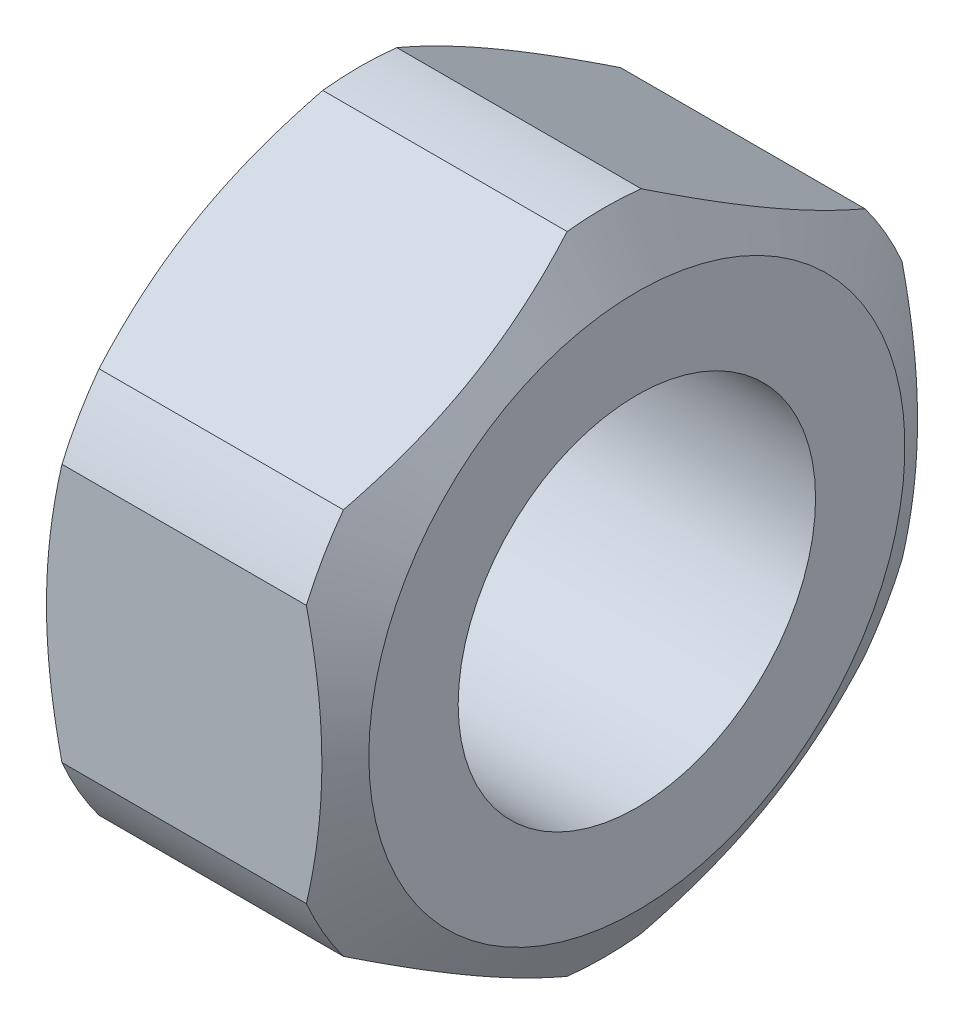
ISO-10303-21;
HEADER;
FILE_DESCRIPTION(('STEP AP214'),'2;1');
FILE_NAME('part.step','',(''),(''),'','','');
FILE_SCHEMA(('AUTOMOTIVE_DESIGN { 1 0 10303 214 1 1 1 1 }'));
ENDSEC;
DATA;
#1=APPLICATION_CONTEXT('core data for automotive mechanical design processes');
#2=APPLICATION_PROTOCOL_DEFINITION('international standard','automotive_design',2000,#1);
#3=PRODUCT_CONTEXT('',#1,'mechanical');
#4=PRODUCT('Part','Part','',(#3));
#5=PRODUCT_RELATED_PRODUCT_CATEGORY('part','',(#4));
#6=PRODUCT_DEFINITION_FORMATION('','',#4);
#7=PRODUCT_DEFINITION_CONTEXT('part definition',#1,'design');
#8=PRODUCT_DEFINITION('design','',#6,#7);
#9=PRODUCT_DEFINITION_SHAPE('','',#8);
#10=(LENGTH_UNIT() NAMED_UNIT(*) SI_UNIT(.MILLI.,.METRE.));
#11=(NAMED_UNIT(*) PLANE_ANGLE_UNIT() SI_UNIT($,.RADIAN.));
#12=(NAMED_UNIT(*) SI_UNIT($,.STERADIAN.) SOLID_ANGLE_UNIT());
#13=UNCERTAINTY_MEASURE_WITH_UNIT(LENGTH_MEASURE(1.E-05),#10,'distance_accuracy_value','');
#14=(GEOMETRIC_REPRESENTATION_CONTEXT(3) GLOBAL_UNCERTAINTY_ASSIGNED_CONTEXT((#13)) GLOBAL_UNIT_ASSIGNED_CONTEXT((#10,
#11,#12)) REPRESENTATION_CONTEXT('',''));
#15=CARTESIAN_POINT('',(0.,0.,0.));
#16=DIRECTION('',(0.,0.,1.));
#17=DIRECTION('',(1.,0.,0.));
#18=AXIS2_PLACEMENT_3D('',#15,#16,#17);
#19=CARTESIAN_POINT('',(2.59999999999999,0.,0.));
#20=DIRECTION('',(-1.,0.,0.));
#21=DIRECTION('',(0.,0.,1.));
#22=AXIS2_PLACEMENT_3D('',#19,#20,#21);
#23=CONICAL_SURFACE('',#22,4.5,1.04719755119658);
#24=CARTESIAN_POINT('',(2.59999999999999,0.,0.));
#25=DIRECTION('',(-1.,0.,0.));
#26=DIRECTION('',(0.,0.,1.));
#27=AXIS2_PLACEMENT_3D('',#24,#25,#26);
#28=CIRCLE('',#27,4.5);
#29=CARTESIAN_POINT('',(2.59999999999999,0.,4.5));
#30=VERTEX_POINT('',#29);
#31=EDGE_CURVE('E133',#30,#30,#28,.T.);
#32=ORIENTED_EDGE('',*,*,#31,.T.);
#33=EDGE_LOOP('',(#32));
#34=FACE_BOUND('',#33,.T.);
#35=CARTESIAN_POINT('',(2.05131724426983,-3.24542936626034,-4.37875144526102));
#36=CARTESIAN_POINT('',(2.07923882489737,-3.30617263599719,-4.27354101585894));
#37=CARTESIAN_POINT('',(2.10528206102695,-3.36713837569772,-4.1679452571766));
#38=CARTESIAN_POINT('',(2.15322100869743,-3.48949300677645,-3.9560208196069));
#39=CARTESIAN_POINT('',(2.17511554419071,-3.55088201304372,-3.84969194172582));
#40=CARTESIAN_POINT('',(2.21436819896125,-3.67408408537616,-3.63629969284827));
#41=CARTESIAN_POINT('',(2.23172209046221,-3.73589749204242,-3.52923573191338));
#42=CARTESIAN_POINT('',(2.26152058518306,-3.85981081626848,-3.31461155861909));
#43=CARTESIAN_POINT('',(2.27396566900335,-3.92191070517744,-3.20705139588438));
#44=CARTESIAN_POINT('',(2.30312584464357,-4.10622630246895,-2.88780741674809));
#45=CARTESIAN_POINT('',(2.3124173444287,-4.22876086738908,-2.67557132462308));
#46=CARTESIAN_POINT('',(2.3100267904695,-4.47368971946696,-2.25134210858466));
#47=CARTESIAN_POINT('',(2.29835980331101,-4.59608404415355,-2.03934891966941));
#48=CARTESIAN_POINT('',(2.26645641965094,-4.77638680874153,-1.72705537065789));
#49=CARTESIAN_POINT('',(2.25385446321645,-4.83466079681659,-1.62612186255223));
#50=CARTESIAN_POINT('',(2.22436980583317,-4.95093995384992,-1.42472045470923));
#51=CARTESIAN_POINT('',(2.20748710749956,-5.00894512297239,-1.32425255468748));
#52=CARTESIAN_POINT('',(2.16956010040713,-5.12515455701401,-1.12297191060857));
#53=CARTESIAN_POINT('',(2.14847921277964,-5.18335580663219,-1.02216438920587));
#54=CARTESIAN_POINT('',(2.10260065602001,-5.29937937474609,-0.821205674357187));
#55=CARTESIAN_POINT('',(2.07780375106761,-5.35720176860576,-0.721054350376964));
#56=CARTESIAN_POINT('',(2.05131724426982,-5.41482467158407,-0.621248554738937));
#57=B_SPLINE_CURVE_WITH_KNOTS('',3,(#35,#36,#37,#38,#39,#40,#41,#42,#43,#44,#45,#46,#47,#48,#49,
#50,#51,#52,#53,#54,#55,#56),.UNSPECIFIED.,.F.,.F.,(4,2,2,2,2,2,2,2,2,2,4),(0.,
0.373965494225851,0.74803683976965,1.12245525216132,1.49683699774156,2.23164238927377,
2.96591975707377,3.31753662460585,3.66915327733021,4.02397933736215,4.37873252912962),.UNSPECIFIED.);
#58=CARTESIAN_POINT('',(2.05151724426983,-3.24586459681212,-4.37799760383234));
#59=VERTEX_POINT('',#58);
#60=CARTESIAN_POINT('',(2.05151724426983,-5.41438944103227,-0.62200239616766));
#61=VERTEX_POINT('',#60);
#62=EDGE_CURVE('E150',#59,#61,#57,.T.);
#63=ORIENTED_EDGE('',*,*,#62,.F.);
#64=CARTESIAN_POINT('',(2.05151724426983,0.,0.));
#65=DIRECTION('',(-1.,0.,0.));
#66=DIRECTION('',(0.,0.,1.));
#67=AXIS2_PLACEMENT_3D('',#64,#65,#66);
#68=CIRCLE('',#67,5.45);
#69=CARTESIAN_POINT('',(2.05151724426983,-2.16852484422014,-5.));
#70=VERTEX_POINT('',#69);
#71=EDGE_CURVE('E146',#70,#59,#68,.T.);
#72=ORIENTED_EDGE('',*,*,#71,.F.);
#73=CARTESIAN_POINT('',(-0.0495672017264119,-7.59034150565798,-5.));
#74=CARTESIAN_POINT('',(0.0560026913540689,-7.37131692534706,-5.));
#75=CARTESIAN_POINT('',(0.160502779935008,-7.15176699008767,-5.));
#76=CARTESIAN_POINT('',(0.366750448458029,-6.71133201523394,-5.));
#77=CARTESIAN_POINT('',(0.468497535890005,-6.49044674528403,-5.));
#78=CARTESIAN_POINT('',(0.669176772372656,-6.04583065445695,-5.));
#79=CARTESIAN_POINT('',(0.768088844596084,-5.82209073827513,-5.));
#80=CARTESIAN_POINT('',(0.961568656579241,-5.37274747739959,-5.));
#81=CARTESIAN_POINT('',(1.05613662838522,-5.14714423299945,-5.));
#82=CARTESIAN_POINT('',(1.24076721401034,-4.69122382459792,-5.));
#83=CARTESIAN_POINT('',(1.3307694759165,-4.46088208304005,-5.));
#84=CARTESIAN_POINT('',(1.5035594328375,-3.99745844994392,-5.));
#85=CARTESIAN_POINT('',(1.5863463180342,-3.76437625415388,-5.));
#86=CARTESIAN_POINT('',(1.7424328736015,-3.29560202899964,-5.));
#87=CARTESIAN_POINT('',(1.81575330313676,-3.05991698440947,-5.));
#88=CARTESIAN_POINT('',(1.95048337535986,-2.5852002286689,-5.));
#89=CARTESIAN_POINT('',(2.01189684875942,-2.34616962047854,-5.));
#90=CARTESIAN_POINT('',(2.1197962499697,-1.86457280933199,-5.));
#91=CARTESIAN_POINT('',(2.16627471497022,-1.62200490192479,-5.));
#92=CARTESIAN_POINT('',(2.24111961743884,-1.13401948311099,-5.));
#93=CARTESIAN_POINT('',(2.26948595579342,-0.888601956118144,-5.));
#94=CARTESIAN_POINT('',(2.30559589977272,-0.397706949149094,-5.));
#95=CARTESIAN_POINT('',(2.31346312981085,-0.152238799128253,-5.));
#96=CARTESIAN_POINT('',(2.30818607206311,0.338417087872911,-5.));
#97=CARTESIAN_POINT('',(2.29504690756262,0.583604878636448,-5.));
#98=CARTESIAN_POINT('',(2.25539266273733,1.00429772178018,-5.));
#99=CARTESIAN_POINT('',(2.23359731276719,1.18027121217217,-5.));
#100=CARTESIAN_POINT('',(2.18063844508255,1.53081361677885,-5.));
#101=CARTESIAN_POINT('',(2.14947347935944,1.70538230960726,-5.));
#102=CARTESIAN_POINT('',(2.04348034692544,2.22727444845192,-5.));
#103=CARTESIAN_POINT('',(1.9562269186882,2.57209623225185,-5.));
#104=CARTESIAN_POINT('',(1.80634256845427,3.0877649138985,-5.));
#105=CARTESIAN_POINT('',(1.75250319995882,3.26131787412038,-5.));
#106=CARTESIAN_POINT('',(1.63959530645157,3.60674690333853,-5.));
#107=CARTESIAN_POINT('',(1.58052631893646,3.77862282252328,-5.));
#108=CARTESIAN_POINT('',(1.45841442369726,4.11983850081856,-5.));
#109=CARTESIAN_POINT('',(1.39539604358607,4.28918712645536,-5.));
#110=CARTESIAN_POINT('',(1.26580008848779,4.62645343194172,-5.));
#111=CARTESIAN_POINT('',(1.19922373418467,4.79437157993151,-5.));
#112=CARTESIAN_POINT('',(1.13120361392375,4.96168904418337,-5.));
#113=B_SPLINE_CURVE_WITH_KNOTS('',3,(#73,#74,#75,#76,#77,#78,#79,#80,#81,#82,#83,#84,#85,#86,
#87,#88,#89,#90,#91,#92,#93,#94,#95,#96,#97,#98,#99,#100,#101,#102,#103,#104,#105,#106,#107,
#108,#109,#110,#111,#112),.UNSPECIFIED.,.F.,.F.,(4,2,2,2,2,2,2,2,2,2,2,2,2,2,2,2,2,2,2,4),(0.,
0.729428370395951,1.45898638361316,2.19283549734381,2.92664536579849,3.66845464347947,
4.41034707123128,5.15058390991073,5.89058220261327,6.63094968894745,7.37132122670016,
8.10721734418481,8.84293401008858,9.3746275776507,9.90640335701116,10.9720203896541,
11.5171157420705,12.0622593505308,12.604300671406,13.146157205745),.UNSPECIFIED.);
#114=CARTESIAN_POINT('',(2.05151724426983,2.16852484422014,-5.));
#115=VERTEX_POINT('',#114);
#116=EDGE_CURVE('E212',#115,#70,#113,.F.);
#117=ORIENTED_EDGE('',*,*,#116,.F.);
#118=CARTESIAN_POINT('',(2.05151724426983,3.24586459681213,-4.37799760383233));
#119=VERTEX_POINT('',#118);
#120=EDGE_CURVE('E149',#119,#115,#68,.T.);
#121=ORIENTED_EDGE('',*,*,#120,.F.);
#122=CARTESIAN_POINT('',(2.05131724426982,5.41482467158406,-0.621248554738949));
#123=CARTESIAN_POINT('',(2.07923882489736,5.35408140184721,-0.726458984141036));
#124=CARTESIAN_POINT('',(2.10528206102694,5.29311566214669,-0.832054742823369));
#125=CARTESIAN_POINT('',(2.15322100869742,5.17076103106796,-1.04397918039307));
#126=CARTESIAN_POINT('',(2.1751155441907,5.10937202480068,-1.15030805827415));
#127=CARTESIAN_POINT('',(2.21436819896125,4.98616995246825,-1.36370030715171));
#128=CARTESIAN_POINT('',(2.2317220904622,4.92435654580199,-1.47076426808659));
#129=CARTESIAN_POINT('',(2.26152058518306,4.80044322157593,-1.68538844138088));
#130=CARTESIAN_POINT('',(2.27396566900335,4.73834333266696,-1.7929486041156));
#131=CARTESIAN_POINT('',(2.30312584464356,4.55402773537546,-2.11219258325188));
#132=CARTESIAN_POINT('',(2.3124173444287,4.43149317045533,-2.3244286753769));
#133=CARTESIAN_POINT('',(2.3100267904695,4.18656431837744,-2.74865789141532));
#134=CARTESIAN_POINT('',(2.29835980331101,4.06416999369085,-2.96065108033057));
#135=CARTESIAN_POINT('',(2.26645641965094,3.88386722910287,-3.27294462934209));
#136=CARTESIAN_POINT('',(2.25385446321645,3.82559324102782,-3.37387813744774));
#137=CARTESIAN_POINT('',(2.22436980583317,3.70931408399449,-3.57527954529074));
#138=CARTESIAN_POINT('',(2.20748710749956,3.65130891487202,-3.67574744531249));
#139=CARTESIAN_POINT('',(2.16956010040714,3.5350994808304,-3.87702808939139));
#140=CARTESIAN_POINT('',(2.14847921277965,3.47689823121222,-3.97783561079409));
#141=CARTESIAN_POINT('',(2.10260065602002,3.36087466309833,-4.17879432564277));
#142=CARTESIAN_POINT('',(2.07780375106762,3.30305226923865,-4.27894564962299));
#143=CARTESIAN_POINT('',(2.05131724426983,3.24542936626035,-4.37875144526102));
#144=B_SPLINE_CURVE_WITH_KNOTS('',3,(#122,#123,#124,#125,#126,#127,#128,#129,#130,#131,#132,
#133,#134,#135,#136,#137,#138,#139,#140,#141,#142,#143),.UNSPECIFIED.,.F.,.F.,(4,2,2,2,2,2,2,2,
2,2,4),(0.,0.373965494225852,0.748036839769652,1.12245525216132,1.49683699774157,
2.23164238927378,2.96591975707378,3.31753662460585,3.6691532773302,4.02397933736213,
4.37873252912959),.UNSPECIFIED.);
#145=CARTESIAN_POINT('',(2.05151724426983,5.41438944103226,-0.622002396167673));
#146=VERTEX_POINT('',#145);
#147=EDGE_CURVE('E219',#146,#119,#144,.T.);
#148=ORIENTED_EDGE('',*,*,#147,.F.);
#149=CARTESIAN_POINT('',(2.05151724426983,5.41438944103226,0.622002396167667));
#150=VERTEX_POINT('',#149);
#151=EDGE_CURVE('E156',#150,#146,#68,.T.);
#152=ORIENTED_EDGE('',*,*,#151,.F.);
#153=CARTESIAN_POINT('',(2.05131724426983,3.24542936626035,4.37875144526102));
#154=CARTESIAN_POINT('',(2.07923882489737,3.3061726359972,4.27354101585893));
#155=CARTESIAN_POINT('',(2.10528206102695,3.36713837569773,4.1679452571766));
#156=CARTESIAN_POINT('',(2.15322100869743,3.48949300677645,3.9560208196069));
#157=CARTESIAN_POINT('',(2.17511554419071,3.55088201304373,3.84969194172582));
#158=CARTESIAN_POINT('',(2.21436819896125,3.67408408537616,3.63629969284826));
#159=CARTESIAN_POINT('',(2.23172209046221,3.73589749204242,3.52923573191338));
#160=CARTESIAN_POINT('',(2.26152058518306,3.85981081626849,3.31461155861909));
#161=CARTESIAN_POINT('',(2.27396566900335,3.92191070517745,3.20705139588437));
#162=CARTESIAN_POINT('',(2.30312584464356,4.10622630246895,2.88780741674809));
#163=CARTESIAN_POINT('',(2.3124173444287,4.22876086738908,2.67557132462308));
#164=CARTESIAN_POINT('',(2.3100267904695,4.47368971946697,2.25134210858466));
#165=CARTESIAN_POINT('',(2.29835980331101,4.59608404415356,2.0393489196694));
#166=CARTESIAN_POINT('',(2.26645641965093,4.77638680874154,1.72705537065789));
#167=CARTESIAN_POINT('',(2.25385446321644,4.8346607968166,1.62612186255223));
#168=CARTESIAN_POINT('',(2.22436980583317,4.95093995384992,1.42472045470923));
#169=CARTESIAN_POINT('',(2.20748710749956,5.00894512297239,1.32425255468748));
#170=CARTESIAN_POINT('',(2.16956010040713,5.12515455701401,1.12297191060857));
#171=CARTESIAN_POINT('',(2.14847921277964,5.1833558066322,1.02216438920588));
#172=CARTESIAN_POINT('',(2.10260065602001,5.29937937474609,0.821205674357192));
#173=CARTESIAN_POINT('',(2.07780375106761,5.35720176860576,0.72105435037697));
#174=CARTESIAN_POINT('',(2.05131724426982,5.41482467158406,0.621248554738944));
#175=B_SPLINE_CURVE_WITH_KNOTS('',3,(#153,#154,#155,#156,#157,#158,#159,#160,#161,#162,#163,
#164,#165,#166,#167,#168,#169,#170,#171,#172,#173,#174),.UNSPECIFIED.,.F.,.F.,(4,2,2,2,2,2,2,2,
2,2,4),(0.,0.37396549422585,0.748036839769649,1.12245525216132,1.49683699774156,
2.23164238927377,2.96591975707377,3.31753662460584,3.6691532773302,4.02397933736214,
4.3787325291296),.UNSPECIFIED.);
#176=CARTESIAN_POINT('',(2.05151724426983,3.24586459681213,4.37799760383233));
#177=VERTEX_POINT('',#176);
#178=EDGE_CURVE('E260',#177,#150,#175,.T.);
#179=ORIENTED_EDGE('',*,*,#178,.F.);
#180=CARTESIAN_POINT('',(2.05151724426983,2.16852484422015,5.));
#181=VERTEX_POINT('',#180);
#182=EDGE_CURVE('E151',#181,#177,#68,.T.);
#183=ORIENTED_EDGE('',*,*,#182,.F.);
#184=CARTESIAN_POINT('',(-0.0495672017264116,-7.59034150565798,5.));
#185=CARTESIAN_POINT('',(0.0560026913540693,-7.37131692534706,5.));
#186=CARTESIAN_POINT('',(0.160502779935008,-7.15176699008768,5.));
#187=CARTESIAN_POINT('',(0.366750448458029,-6.71133201523395,5.));
#188=CARTESIAN_POINT('',(0.468497535890004,-6.49044674528403,5.));
#189=CARTESIAN_POINT('',(0.669176772372656,-6.04583065445695,5.));
#190=CARTESIAN_POINT('',(0.768088844596084,-5.82209073827513,5.));
#191=CARTESIAN_POINT('',(0.961568656579242,-5.37274747739959,5.));
#192=CARTESIAN_POINT('',(1.05613662838522,-5.14714423299945,5.));
#193=CARTESIAN_POINT('',(1.24076721401034,-4.69122382459792,5.));
#194=CARTESIAN_POINT('',(1.3307694759165,-4.46088208304005,5.));
#195=CARTESIAN_POINT('',(1.5035594328375,-3.99745844994392,5.));
#196=CARTESIAN_POINT('',(1.5863463180342,-3.76437625415388,5.));
#197=CARTESIAN_POINT('',(1.74243287360151,-3.29560202899965,5.));
#198=CARTESIAN_POINT('',(1.81575330313676,-3.05991698440947,5.));
#199=CARTESIAN_POINT('',(1.95048337535986,-2.5852002286689,5.));
#200=CARTESIAN_POINT('',(2.01189684875942,-2.34616962047854,5.));
#201=CARTESIAN_POINT('',(2.1197962499697,-1.86457280933199,5.));
#202=CARTESIAN_POINT('',(2.16627471497022,-1.62200490192479,5.));
#203=CARTESIAN_POINT('',(2.24111961743884,-1.134019483111,5.));
#204=CARTESIAN_POINT('',(2.26948595579343,-0.888601956118146,5.));
#205=CARTESIAN_POINT('',(2.30559589977272,-0.397706949149096,5.));
#206=CARTESIAN_POINT('',(2.31346312981085,-0.152238799128255,5.));
#207=CARTESIAN_POINT('',(2.30818607206312,0.338417087872909,5.));
#208=CARTESIAN_POINT('',(2.29504690756262,0.583604878636445,5.));
#209=CARTESIAN_POINT('',(2.25539266273733,1.00429772178018,5.));
#210=CARTESIAN_POINT('',(2.2335973127672,1.18027121217216,5.));
#211=CARTESIAN_POINT('',(2.18063844508255,1.53081361677885,5.));
#212=CARTESIAN_POINT('',(2.14947347935944,1.70538230960725,5.));
#213=CARTESIAN_POINT('',(2.04348034692544,2.22727444845192,5.));
#214=CARTESIAN_POINT('',(1.95622691868821,2.57209623225185,5.));
#215=CARTESIAN_POINT('',(1.80634256845427,3.0877649138985,5.));
#216=CARTESIAN_POINT('',(1.75250319995882,3.26131787412038,5.));
#217=CARTESIAN_POINT('',(1.63959530645157,3.60674690333852,5.));
#218=CARTESIAN_POINT('',(1.58052631893646,3.77862282252328,5.));
#219=CARTESIAN_POINT('',(1.45841442369727,4.11983850081856,5.));
#220=CARTESIAN_POINT('',(1.39539604358607,4.28918712645535,5.));
#221=CARTESIAN_POINT('',(1.26580008848779,4.62645343194171,5.));
#222=CARTESIAN_POINT('',(1.19922373418468,4.7943715799315,5.));
#223=CARTESIAN_POINT('',(1.13120361392375,4.96168904418336,5.));
#224=B_SPLINE_CURVE_WITH_KNOTS('',3,(#184,#185,#186,#187,#188,#189,#190,#191,#192,#193,#194,
#195,#196,#197,#198,#199,#200,#201,#202,#203,#204,#205,#206,#207,#208,#209,#210,#211,#212,#213,
#214,#215,#216,#217,#218,#219,#220,#221,#222,#223),.UNSPECIFIED.,.F.,.F.,(4,2,2,2,2,2,2,2,2,2,2,
2,2,2,2,2,2,2,2,4),(0.,0.729428370395949,1.45898638361316,2.19283549734381,2.92664536579849,
3.66845464347947,4.41034707123128,5.15058390991072,5.89058220261327,6.63094968894745,
7.37132122670016,8.10721734418481,8.84293401008857,9.3746275776507,9.90640335701116,
10.9720203896541,11.5171157420705,12.0622593505308,12.604300671406,13.146157205745),.UNSPECIFIED.);
#225=CARTESIAN_POINT('',(2.05151724426983,-2.16852484422015,5.));
#226=VERTEX_POINT('',#225);
#227=EDGE_CURVE('E272',#226,#181,#224,.T.);
#228=ORIENTED_EDGE('',*,*,#227,.F.);
#229=CARTESIAN_POINT('',(2.05151724426983,-3.24586459681212,4.37799760383234));
#230=VERTEX_POINT('',#229);
#231=EDGE_CURVE('E142',#230,#226,#68,.T.);
#232=ORIENTED_EDGE('',*,*,#231,.F.);
#233=CARTESIAN_POINT('',(2.05131724426982,-5.41482467158407,0.621248554738933));
#234=CARTESIAN_POINT('',(2.07923882489736,-5.35408140184721,0.726458984141021));
#235=CARTESIAN_POINT('',(2.10528206102694,-5.29311566214669,0.832054742823354));
#236=CARTESIAN_POINT('',(2.15322100869742,-5.17076103106796,1.04397918039306));
#237=CARTESIAN_POINT('',(2.1751155441907,-5.10937202480069,1.15030805827414));
#238=CARTESIAN_POINT('',(2.21436819896125,-4.98616995246825,1.36370030715169));
#239=CARTESIAN_POINT('',(2.2317220904622,-4.92435654580199,1.47076426808657));
#240=CARTESIAN_POINT('',(2.26152058518306,-4.80044322157593,1.68538844138087));
#241=CARTESIAN_POINT('',(2.27396566900335,-4.73834333266696,1.79294860411558));
#242=CARTESIAN_POINT('',(2.30312584464356,-4.55402773537546,2.11219258325187));
#243=CARTESIAN_POINT('',(2.3124173444287,-4.43149317045533,2.32442867537688));
#244=CARTESIAN_POINT('',(2.3100267904695,-4.18656431837744,2.7486578914153));
#245=CARTESIAN_POINT('',(2.29835980331101,-4.06416999369085,2.96065108033056));
#246=CARTESIAN_POINT('',(2.26645641965094,-3.88386722910287,3.27294462934207));
#247=CARTESIAN_POINT('',(2.25385446321645,-3.82559324102781,3.37387813744773));
#248=CARTESIAN_POINT('',(2.22436980583318,-3.70931408399449,3.57527954529073));
#249=CARTESIAN_POINT('',(2.20748710749956,-3.65130891487202,3.67574744531248));
#250=CARTESIAN_POINT('',(2.16956010040714,-3.5350994808304,3.87702808939139));
#251=CARTESIAN_POINT('',(2.14847921277965,-3.47689823121221,3.97783561079409));
#252=CARTESIAN_POINT('',(2.10260065602002,-3.36087466309832,4.17879432564277));
#253=CARTESIAN_POINT('',(2.07780375106762,-3.30305226923864,4.278945649623));
#254=CARTESIAN_POINT('',(2.05131724426983,-3.24542936626034,4.37875144526102));
#255=B_SPLINE_CURVE_WITH_KNOTS('',3,(#233,#234,#235,#236,#237,#238,#239,#240,#241,#242,#243,
#244,#245,#246,#247,#248,#249,#250,#251,#252,#253,#254),.UNSPECIFIED.,.F.,.F.,(4,2,2,2,2,2,2,2,
2,2,4),(0.,0.373965494225852,0.748036839769652,1.12245525216132,1.49683699774157,
2.23164238927378,2.96591975707378,3.31753662460586,3.66915327733022,4.02397933736215,
4.37873252912962),.UNSPECIFIED.);
#256=CARTESIAN_POINT('',(2.05151724426983,-5.41438944103227,0.622002396167658));
#257=VERTEX_POINT('',#256);
#258=EDGE_CURVE('E126',#257,#230,#255,.T.);
#259=ORIENTED_EDGE('',*,*,#258,.F.);
#260=EDGE_CURVE('E139',#61,#257,#68,.T.);
#261=ORIENTED_EDGE('',*,*,#260,.F.);
#262=EDGE_LOOP('',(#63,#72,#117,#121,#148,#152,#179,#183,#228,#232,#259,#261));
#263=FACE_BOUND('',#262,.T.);
#264=ADVANCED_FACE('F38',(#34,#263),#23,.T.);
#265=CARTESIAN_POINT('',(-2.05151724426983,0.,0.));
#266=DIRECTION('',(1.,0.,0.));
#267=DIRECTION('',(0.,0.,-1.));
#268=AXIS2_PLACEMENT_3D('',#265,#266,#267);
#269=CONICAL_SURFACE('',#268,5.45,1.04719755119658);
#270=CARTESIAN_POINT('',(-2.59999999999999,0.,0.));
#271=DIRECTION('',(-1.,0.,0.));
#272=DIRECTION('',(0.,0.,1.));
#273=AXIS2_PLACEMENT_3D('',#270,#271,#272);
#274=CIRCLE('',#273,4.5);
#275=CARTESIAN_POINT('',(-2.59999999999999,0.,4.5));
#276=VERTEX_POINT('',#275);
#277=EDGE_CURVE('E166',#276,#276,#274,.T.);
#278=ORIENTED_EDGE('',*,*,#277,.F.);
#279=EDGE_LOOP('',(#278));
#280=FACE_BOUND('',#279,.T.);
#281=CARTESIAN_POINT('',(-2.05131724426982,-5.41482467158407,-0.621248554738937));
#282=CARTESIAN_POINT('',(-2.07923882489736,-5.35408140184721,-0.726458984141024));
#283=CARTESIAN_POINT('',(-2.10528206102694,-5.29311566214669,-0.832054742823357));
#284=CARTESIAN_POINT('',(-2.15322100869742,-5.17076103106796,-1.04397918039306));
#285=CARTESIAN_POINT('',(-2.1751155441907,-5.10937202480068,-1.15030805827414));
#286=CARTESIAN_POINT('',(-2.21436819896125,-4.98616995246825,-1.36370030715169));
#287=CARTESIAN_POINT('',(-2.2317220904622,-4.92435654580199,-1.47076426808658));
#288=CARTESIAN_POINT('',(-2.26152058518306,-4.80044322157593,-1.68538844138087));
#289=CARTESIAN_POINT('',(-2.27396566900335,-4.73834333266696,-1.79294860411558));
#290=CARTESIAN_POINT('',(-2.30312584464356,-4.55402773537546,-2.11219258325187));
#291=CARTESIAN_POINT('',(-2.3124173444287,-4.43149317045533,-2.32442867537688));
#292=CARTESIAN_POINT('',(-2.3100267904695,-4.18656431837744,-2.7486578914153));
#293=CARTESIAN_POINT('',(-2.29835980331101,-4.06416999369085,-2.96065108033056));
#294=CARTESIAN_POINT('',(-2.26645641965094,-3.88386722910287,-3.27294462934208));
#295=CARTESIAN_POINT('',(-2.25385446321645,-3.82559324102781,-3.37387813744774));
#296=CARTESIAN_POINT('',(-2.22436980583318,-3.70931408399449,-3.57527954529073));
#297=CARTESIAN_POINT('',(-2.20748710749956,-3.65130891487201,-3.67574744531248));
#298=CARTESIAN_POINT('',(-2.16956010040714,-3.5350994808304,-3.87702808939139));
#299=CARTESIAN_POINT('',(-2.14847921277965,-3.47689823121221,-3.97783561079409));
#300=CARTESIAN_POINT('',(-2.10260065602002,-3.36087466309832,-4.17879432564278));
#301=CARTESIAN_POINT('',(-2.07780375106762,-3.30305226923864,-4.278945649623));
#302=CARTESIAN_POINT('',(-2.05131724426983,-3.24542936626034,-4.37875144526102));
#303=B_SPLINE_CURVE_WITH_KNOTS('',3,(#281,#282,#283,#284,#285,#286,#287,#288,#289,#290,#291,
#292,#293,#294,#295,#296,#297,#298,#299,#300,#301,#302),.UNSPECIFIED.,.F.,.F.,(4,2,2,2,2,2,2,2,
2,2,4),(0.,0.373965494225852,0.748036839769652,1.12245525216132,1.49683699774157,
2.23164238927378,2.96591975707378,3.31753662460585,3.66915327733022,4.02397933736215,
4.37873252912962),.UNSPECIFIED.);
#304=CARTESIAN_POINT('',(-2.05151724426983,-5.41438944103227,-0.62200239616766));
#305=VERTEX_POINT('',#304);
#306=CARTESIAN_POINT('',(-2.05151724426983,-3.24586459681212,-4.37799760383234));
#307=VERTEX_POINT('',#306);
#308=EDGE_CURVE('E198',#305,#307,#303,.T.);
#309=ORIENTED_EDGE('',*,*,#308,.F.);
#310=CARTESIAN_POINT('',(-2.05151724426983,0.,0.));
#311=DIRECTION('',(-1.,0.,0.));
#312=DIRECTION('',(0.,0.,1.));
#313=AXIS2_PLACEMENT_3D('',#310,#311,#312);
#314=CIRCLE('',#313,5.45);
#315=CARTESIAN_POINT('',(-2.05151724426983,-5.41438944103227,0.622002396167658));
#316=VERTEX_POINT('',#315);
#317=EDGE_CURVE('E454',#305,#316,#314,.T.);
#318=ORIENTED_EDGE('',*,*,#317,.T.);
#319=CARTESIAN_POINT('',(-2.05131724426983,-3.24542936626034,4.37875144526102));
#320=CARTESIAN_POINT('',(-2.07923882489737,-3.30617263599719,4.27354101585894));
#321=CARTESIAN_POINT('',(-2.10528206102695,-3.36713837569772,4.1679452571766));
#322=CARTESIAN_POINT('',(-2.15322100869743,-3.48949300677645,3.9560208196069));
#323=CARTESIAN_POINT('',(-2.17511554419071,-3.55088201304372,3.84969194172582));
#324=CARTESIAN_POINT('',(-2.21436819896125,-3.67408408537616,3.63629969284827));
#325=CARTESIAN_POINT('',(-2.23172209046221,-3.73589749204242,3.52923573191338));
#326=CARTESIAN_POINT('',(-2.26152058518307,-3.85981081626848,3.31461155861909));
#327=CARTESIAN_POINT('',(-2.27396566900335,-3.92191070517745,3.20705139588438));
#328=CARTESIAN_POINT('',(-2.30312584464357,-4.10622630246895,2.88780741674809));
#329=CARTESIAN_POINT('',(-2.3124173444287,-4.22876086738908,2.67557132462308));
#330=CARTESIAN_POINT('',(-2.3100267904695,-4.47368971946696,2.25134210858466));
#331=CARTESIAN_POINT('',(-2.29835980331101,-4.59608404415355,2.03934891966941));
#332=CARTESIAN_POINT('',(-2.26645641965094,-4.77638680874153,1.72705537065789));
#333=CARTESIAN_POINT('',(-2.25385446321644,-4.83466079681659,1.62612186255223));
#334=CARTESIAN_POINT('',(-2.22436980583317,-4.95093995384992,1.42472045470923));
#335=CARTESIAN_POINT('',(-2.20748710749956,-5.00894512297239,1.32425255468748));
#336=CARTESIAN_POINT('',(-2.16956010040713,-5.12515455701401,1.12297191060857));
#337=CARTESIAN_POINT('',(-2.14847921277964,-5.1833558066322,1.02216438920587));
#338=CARTESIAN_POINT('',(-2.10260065602001,-5.29937937474609,0.821205674357184));
#339=CARTESIAN_POINT('',(-2.0778037510676,-5.35720176860577,0.72105435037696));
#340=CARTESIAN_POINT('',(-2.05131724426982,-5.41482467158407,0.621248554738933));
#341=B_SPLINE_CURVE_WITH_KNOTS('',3,(#319,#320,#321,#322,#323,#324,#325,#326,#327,#328,#329,
#330,#331,#332,#333,#334,#335,#336,#337,#338,#339,#340),.UNSPECIFIED.,.F.,.F.,(4,2,2,2,2,2,2,2,
2,2,4),(0.,0.373965494225851,0.748036839769649,1.12245525216132,1.49683699774156,
2.23164238927377,2.96591975707377,3.31753662460585,3.66915327733021,4.02397933736215,
4.37873252912962),.UNSPECIFIED.);
#342=CARTESIAN_POINT('',(-2.05151724426983,-3.24586459681212,4.37799760383234));
#343=VERTEX_POINT('',#342);
#344=EDGE_CURVE('E61',#343,#316,#341,.T.);
#345=ORIENTED_EDGE('',*,*,#344,.F.);
#346=CARTESIAN_POINT('',(-2.05151724426983,-2.16852484422015,5.));
#347=VERTEX_POINT('',#346);
#348=EDGE_CURVE('E155',#343,#347,#314,.T.);
#349=ORIENTED_EDGE('',*,*,#348,.T.);
#350=CARTESIAN_POINT('',(0.0495672017264118,-7.59034150565798,5.));
#351=CARTESIAN_POINT('',(-0.0560026913540695,-7.37131692534706,5.));
#352=CARTESIAN_POINT('',(-0.160502779935009,-7.15176699008768,5.));
#353=CARTESIAN_POINT('',(-0.36675044845803,-6.71133201523394,5.));
#354=CARTESIAN_POINT('',(-0.468497535890006,-6.49044674528403,5.));
#355=CARTESIAN_POINT('',(-0.669176772372657,-6.04583065445695,5.));
#356=CARTESIAN_POINT('',(-0.768088844596085,-5.82209073827513,5.));
#357=CARTESIAN_POINT('',(-0.961568656579242,-5.37274747739959,5.));
#358=CARTESIAN_POINT('',(-1.05613662838522,-5.14714423299945,5.));
#359=CARTESIAN_POINT('',(-1.24076721401034,-4.69122382459792,5.));
#360=CARTESIAN_POINT('',(-1.3307694759165,-4.46088208304005,5.));
#361=CARTESIAN_POINT('',(-1.5035594328375,-3.99745844994392,5.));
#362=CARTESIAN_POINT('',(-1.5863463180342,-3.76437625415388,5.));
#363=CARTESIAN_POINT('',(-1.74243287360151,-3.29560202899965,5.));
#364=CARTESIAN_POINT('',(-1.81575330313676,-3.05991698440947,5.));
#365=CARTESIAN_POINT('',(-1.95048337535986,-2.5852002286689,5.));
#366=CARTESIAN_POINT('',(-2.01189684875942,-2.34616962047854,5.));
#367=CARTESIAN_POINT('',(-2.11979624996971,-1.86457280933199,5.));
#368=CARTESIAN_POINT('',(-2.16627471497022,-1.62200490192479,5.));
#369=CARTESIAN_POINT('',(-2.24111961743884,-1.134019483111,5.));
#370=CARTESIAN_POINT('',(-2.26948595579343,-0.888601956118146,5.));
#371=CARTESIAN_POINT('',(-2.30559589977272,-0.397706949149096,5.));
#372=CARTESIAN_POINT('',(-2.31346312981085,-0.152238799128255,5.));
#373=CARTESIAN_POINT('',(-2.30818607206312,0.338417087872909,5.));
#374=CARTESIAN_POINT('',(-2.29504690756262,0.583604878636445,5.));
#375=CARTESIAN_POINT('',(-2.25539266273733,1.00429772178018,5.));
#376=CARTESIAN_POINT('',(-2.2335973127672,1.18027121217216,5.));
#377=CARTESIAN_POINT('',(-2.18063844508255,1.53081361677885,5.));
#378=CARTESIAN_POINT('',(-2.14947347935944,1.70538230960725,5.));
#379=CARTESIAN_POINT('',(-2.04348034692544,2.22727444845192,5.));
#380=CARTESIAN_POINT('',(-1.95622691868821,2.57209623225185,5.));
#381=CARTESIAN_POINT('',(-1.80634256845427,3.0877649138985,5.));
#382=CARTESIAN_POINT('',(-1.75250319995882,3.26131787412038,5.));
#383=CARTESIAN_POINT('',(-1.63959530645157,3.60674690333852,5.));
#384=CARTESIAN_POINT('',(-1.58052631893646,3.77862282252328,5.));
#385=CARTESIAN_POINT('',(-1.45841442369727,4.11983850081856,5.));
#386=CARTESIAN_POINT('',(-1.39539604358607,4.28918712645535,5.));
#387=CARTESIAN_POINT('',(-1.26580008848779,4.62645343194171,5.));
#388=CARTESIAN_POINT('',(-1.19922373418468,4.7943715799315,5.));
#389=CARTESIAN_POINT('',(-1.13120361392375,4.96168904418336,5.));
#390=B_SPLINE_CURVE_WITH_KNOTS('',3,(#350,#351,#352,#353,#354,#355,#356,#357,#358,#359,#360,
#361,#362,#363,#364,#365,#366,#367,#368,#369,#370,#371,#372,#373,#374,#375,#376,#377,#378,#379,
#380,#381,#382,#383,#384,#385,#386,#387,#388,#389),.UNSPECIFIED.,.F.,.F.,(4,2,2,2,2,2,2,2,2,2,2,
2,2,2,2,2,2,2,2,4),(0.,0.72942837039595,1.45898638361317,2.19283549734382,2.92664536579849,
3.66845464347947,4.41034707123128,5.15058390991073,5.89058220261327,6.63094968894745,
7.37132122670016,8.10721734418481,8.84293401008857,9.3746275776507,9.90640335701116,
10.9720203896541,11.5171157420705,12.0622593505308,12.604300671406,13.146157205745),.UNSPECIFIED.);
#391=CARTESIAN_POINT('',(-2.05151724426983,2.16852484422015,5.));
#392=VERTEX_POINT('',#391);
#393=EDGE_CURVE('E53',#392,#347,#390,.F.);
#394=ORIENTED_EDGE('',*,*,#393,.F.);
#395=CARTESIAN_POINT('',(-2.05151724426983,3.24586459681213,4.37799760383233));
#396=VERTEX_POINT('',#395);
#397=EDGE_CURVE('E163',#392,#396,#314,.T.);
#398=ORIENTED_EDGE('',*,*,#397,.T.);
#399=CARTESIAN_POINT('',(-2.05131724426982,5.41482467158406,0.621248554738945));
#400=CARTESIAN_POINT('',(-2.07923882489736,5.35408140184721,0.726458984141032));
#401=CARTESIAN_POINT('',(-2.10528206102694,5.29311566214669,0.832054742823365));
#402=CARTESIAN_POINT('',(-2.15322100869742,5.17076103106796,1.04397918039307));
#403=CARTESIAN_POINT('',(-2.1751155441907,5.10937202480068,1.15030805827415));
#404=CARTESIAN_POINT('',(-2.21436819896125,4.98616995246825,1.3637003071517));
#405=CARTESIAN_POINT('',(-2.2317220904622,4.92435654580199,1.47076426808658));
#406=CARTESIAN_POINT('',(-2.26152058518306,4.80044322157593,1.68538844138088));
#407=CARTESIAN_POINT('',(-2.27396566900335,4.73834333266696,1.79294860411559));
#408=CARTESIAN_POINT('',(-2.30312584464356,4.55402773537546,2.11219258325188));
#409=CARTESIAN_POINT('',(-2.3124173444287,4.43149317045533,2.32442867537689));
#410=CARTESIAN_POINT('',(-2.3100267904695,4.18656431837744,2.74865789141531));
#411=CARTESIAN_POINT('',(-2.29835980331101,4.06416999369085,2.96065108033057));
#412=CARTESIAN_POINT('',(-2.26645641965094,3.88386722910287,3.27294462934208));
#413=CARTESIAN_POINT('',(-2.25385446321645,3.82559324102781,3.37387813744774));
#414=CARTESIAN_POINT('',(-2.22436980583317,3.70931408399449,3.57527954529074));
#415=CARTESIAN_POINT('',(-2.20748710749956,3.65130891487202,3.67574744531249));
#416=CARTESIAN_POINT('',(-2.16956010040714,3.5350994808304,3.87702808939139));
#417=CARTESIAN_POINT('',(-2.14847921277965,3.47689823121221,3.97783561079409));
#418=CARTESIAN_POINT('',(-2.10260065602002,3.36087466309833,4.17879432564277));
#419=CARTESIAN_POINT('',(-2.07780375106762,3.30305226923865,4.27894564962299));
#420=CARTESIAN_POINT('',(-2.05131724426983,3.24542936626035,4.37875144526102));
#421=B_SPLINE_CURVE_WITH_KNOTS('',3,(#399,#400,#401,#402,#403,#404,#405,#406,#407,#408,#409,
#410,#411,#412,#413,#414,#415,#416,#417,#418,#419,#420),.UNSPECIFIED.,.F.,.F.,(4,2,2,2,2,2,2,2,
2,2,4),(0.,0.373965494225852,0.748036839769651,1.12245525216132,1.49683699774157,
2.23164238927378,2.96591975707378,3.31753662460585,3.66915327733021,4.02397933736214,
4.3787325291296),.UNSPECIFIED.);
#422=CARTESIAN_POINT('',(-2.05151724426983,5.41438944103226,0.622002396167667));
#423=VERTEX_POINT('',#422);
#424=EDGE_CURVE('E266',#423,#396,#421,.T.);
#425=ORIENTED_EDGE('',*,*,#424,.F.);
#426=CARTESIAN_POINT('',(-2.05151724426983,5.41438944103226,-0.622002396167673));
#427=VERTEX_POINT('',#426);
#428=EDGE_CURVE('E167',#423,#427,#314,.T.);
#429=ORIENTED_EDGE('',*,*,#428,.T.);
#430=CARTESIAN_POINT('',(-2.05131724426983,3.24542936626035,-4.37875144526101));
#431=CARTESIAN_POINT('',(-2.07923882489737,3.3061726359972,-4.27354101585893));
#432=CARTESIAN_POINT('',(-2.10528206102695,3.36713837569773,-4.16794525717659));
#433=CARTESIAN_POINT('',(-2.15322100869743,3.48949300677646,-3.95602081960689));
#434=CARTESIAN_POINT('',(-2.17511554419071,3.55088201304373,-3.84969194172581));
#435=CARTESIAN_POINT('',(-2.21436819896125,3.67408408537617,-3.63629969284826));
#436=CARTESIAN_POINT('',(-2.23172209046221,3.73589749204243,-3.52923573191338));
#437=CARTESIAN_POINT('',(-2.26152058518306,3.85981081626849,-3.31461155861908));
#438=CARTESIAN_POINT('',(-2.27396566900335,3.92191070517746,-3.20705139588437));
#439=CARTESIAN_POINT('',(-2.30312584464356,4.10622630246896,-2.88780741674808));
#440=CARTESIAN_POINT('',(-2.3124173444287,4.22876086738909,-2.67557132462307));
#441=CARTESIAN_POINT('',(-2.3100267904695,4.47368971946697,-2.25134210858465));
#442=CARTESIAN_POINT('',(-2.29835980331101,4.59608404415356,-2.0393489196694));
#443=CARTESIAN_POINT('',(-2.26645641965093,4.77638680874154,-1.72705537065788));
#444=CARTESIAN_POINT('',(-2.25385446321644,4.8346607968166,-1.62612186255222));
#445=CARTESIAN_POINT('',(-2.22436980583317,4.95093995384992,-1.42472045470923));
#446=CARTESIAN_POINT('',(-2.20748710749956,5.0089451229724,-1.32425255468748));
#447=CARTESIAN_POINT('',(-2.16956010040713,5.12515455701401,-1.12297191060858));
#448=CARTESIAN_POINT('',(-2.14847921277964,5.1833558066322,-1.02216438920588));
#449=CARTESIAN_POINT('',(-2.10260065602001,5.29937937474609,-0.821205674357194));
#450=CARTESIAN_POINT('',(-2.0778037510676,5.35720176860576,-0.721054350376973));
#451=CARTESIAN_POINT('',(-2.05131724426982,5.41482467158406,-0.621248554738948));
#452=B_SPLINE_CURVE_WITH_KNOTS('',3,(#430,#431,#432,#433,#434,#435,#436,#437,#438,#439,#440,
#441,#442,#443,#444,#445,#446,#447,#448,#449,#450,#451),.UNSPECIFIED.,.F.,.F.,(4,2,2,2,2,2,2,2,
2,2,4),(0.,0.373965494225851,0.74803683976965,1.12245525216132,1.49683699774156,
2.23164238927377,2.96591975707377,3.31753662460584,3.6691532773302,4.02397933736213,
4.37873252912959),.UNSPECIFIED.);
#453=CARTESIAN_POINT('',(-2.05151724426983,3.24586459681213,-4.37799760383233));
#454=VERTEX_POINT('',#453);
#455=EDGE_CURVE('E222',#454,#427,#452,.T.);
#456=ORIENTED_EDGE('',*,*,#455,.F.);
#457=CARTESIAN_POINT('',(-2.05151724426983,2.16852484422014,-5.));
#458=VERTEX_POINT('',#457);
#459=EDGE_CURVE('E218',#454,#458,#314,.T.);
#460=ORIENTED_EDGE('',*,*,#459,.T.);
#461=CARTESIAN_POINT('',(0.0495672017264119,-7.59034150565798,-5.));
#462=CARTESIAN_POINT('',(-0.0560026913540692,-7.37131692534706,-5.));
#463=CARTESIAN_POINT('',(-0.160502779935009,-7.15176699008767,-5.));
#464=CARTESIAN_POINT('',(-0.366750448458029,-6.71133201523394,-5.));
#465=CARTESIAN_POINT('',(-0.468497535890005,-6.49044674528403,-5.));
#466=CARTESIAN_POINT('',(-0.669176772372656,-6.04583065445695,-5.));
#467=CARTESIAN_POINT('',(-0.768088844596084,-5.82209073827513,-5.));
#468=CARTESIAN_POINT('',(-0.961568656579242,-5.37274747739959,-5.));
#469=CARTESIAN_POINT('',(-1.05613662838522,-5.14714423299945,-5.));
#470=CARTESIAN_POINT('',(-1.24076721401034,-4.69122382459792,-5.));
#471=CARTESIAN_POINT('',(-1.3307694759165,-4.46088208304005,-5.));
#472=CARTESIAN_POINT('',(-1.5035594328375,-3.99745844994392,-5.));
#473=CARTESIAN_POINT('',(-1.5863463180342,-3.76437625415388,-5.));
#474=CARTESIAN_POINT('',(-1.7424328736015,-3.29560202899964,-5.));
#475=CARTESIAN_POINT('',(-1.81575330313676,-3.05991698440947,-5.));
#476=CARTESIAN_POINT('',(-1.95048337535986,-2.5852002286689,-5.));
#477=CARTESIAN_POINT('',(-2.01189684875942,-2.34616962047854,-5.));
#478=CARTESIAN_POINT('',(-2.1197962499697,-1.86457280933199,-5.));
#479=CARTESIAN_POINT('',(-2.16627471497022,-1.62200490192479,-5.));
#480=CARTESIAN_POINT('',(-2.24111961743884,-1.13401948311099,-5.));
#481=CARTESIAN_POINT('',(-2.26948595579342,-0.888601956118144,-5.));
#482=CARTESIAN_POINT('',(-2.30559589977272,-0.397706949149094,-5.));
#483=CARTESIAN_POINT('',(-2.31346312981085,-0.152238799128253,-5.));
#484=CARTESIAN_POINT('',(-2.30818607206311,0.338417087872911,-5.));
#485=CARTESIAN_POINT('',(-2.29504690756262,0.583604878636448,-5.));
#486=CARTESIAN_POINT('',(-2.25539266273733,1.00429772178018,-5.));
#487=CARTESIAN_POINT('',(-2.23359731276719,1.18027121217217,-5.));
#488=CARTESIAN_POINT('',(-2.18063844508255,1.53081361677885,-5.));
#489=CARTESIAN_POINT('',(-2.14947347935944,1.70538230960726,-5.));
#490=CARTESIAN_POINT('',(-2.04348034692544,2.22727444845192,-5.));
#491=CARTESIAN_POINT('',(-1.9562269186882,2.57209623225185,-5.));
#492=CARTESIAN_POINT('',(-1.80634256845427,3.0877649138985,-5.));
#493=CARTESIAN_POINT('',(-1.75250319995882,3.26131787412038,-5.));
#494=CARTESIAN_POINT('',(-1.63959530645157,3.60674690333853,-5.));
#495=CARTESIAN_POINT('',(-1.58052631893646,3.77862282252328,-5.));
#496=CARTESIAN_POINT('',(-1.45841442369726,4.11983850081856,-5.));
#497=CARTESIAN_POINT('',(-1.39539604358607,4.28918712645536,-5.));
#498=CARTESIAN_POINT('',(-1.26580008848779,4.62645343194172,-5.));
#499=CARTESIAN_POINT('',(-1.19922373418467,4.79437157993151,-5.));
#500=CARTESIAN_POINT('',(-1.13120361392375,4.96168904418337,-5.));
#501=B_SPLINE_CURVE_WITH_KNOTS('',3,(#461,#462,#463,#464,#465,#466,#467,#468,#469,#470,#471,
#472,#473,#474,#475,#476,#477,#478,#479,#480,#481,#482,#483,#484,#485,#486,#487,#488,#489,#490,
#491,#492,#493,#494,#495,#496,#497,#498,#499,#500),.UNSPECIFIED.,.F.,.F.,(4,2,2,2,2,2,2,2,2,2,2,
2,2,2,2,2,2,2,2,4),(0.,0.729428370395951,1.45898638361316,2.19283549734381,2.92664536579849,
3.66845464347947,4.41034707123128,5.15058390991073,5.89058220261327,6.63094968894745,
7.37132122670016,8.10721734418481,8.84293401008858,9.3746275776507,9.90640335701116,
10.9720203896541,11.5171157420705,12.0622593505308,12.604300671406,13.146157205745),.UNSPECIFIED.);
#502=CARTESIAN_POINT('',(-2.05151724426983,-2.16852484422014,-5.));
#503=VERTEX_POINT('',#502);
#504=EDGE_CURVE('E210',#503,#458,#501,.T.);
#505=ORIENTED_EDGE('',*,*,#504,.F.);
#506=EDGE_CURVE('E206',#503,#307,#314,.T.);
#507=ORIENTED_EDGE('',*,*,#506,.T.);
#508=EDGE_LOOP('',(#309,#318,#345,#349,#394,#398,#425,#429,#456,#460,#505,#507));
#509=FACE_BOUND('',#508,.T.);
#510=ADVANCED_FACE('F215',(#280,#509),#269,.T.);
#511=CARTESIAN_POINT('',(-345.378129482521,0.,0.));
#512=DIRECTION('',(-1.,0.,0.));
#513=DIRECTION('',(0.,0.,1.));
#514=AXIS2_PLACEMENT_3D('',#511,#512,#513);
#515=CYLINDRICAL_SURFACE('',#514,5.45);
#516=DIRECTION('',(-1.,0.,0.));
#517=VECTOR('',#516,1.);
#518=CARTESIAN_POINT('',(-345.378129482521,-5.41438944103226,-0.622002396167663));
#519=LINE('',#518,#517);
#520=EDGE_CURVE('E12',#61,#305,#519,.T.);
#521=ORIENTED_EDGE('',*,*,#520,.F.);
#522=ORIENTED_EDGE('',*,*,#260,.T.);
#523=DIRECTION('',(-1.,0.,0.));
#524=VECTOR('',#523,1.);
#525=CARTESIAN_POINT('',(-345.378129482521,-5.41438944103227,0.622002396167658));
#526=LINE('',#525,#524);
#527=EDGE_CURVE('E123',#316,#257,#526,.F.);
#528=ORIENTED_EDGE('',*,*,#527,.F.);
#529=ORIENTED_EDGE('',*,*,#317,.F.);
#530=EDGE_LOOP('',(#521,#522,#528,#529));
#531=FACE_BOUND('',#530,.T.);
#532=ADVANCED_FACE('F145',(#531),#515,.T.);
#533=DIRECTION('',(-1.,0.,0.));
#534=VECTOR('',#533,1.);
#535=CARTESIAN_POINT('',(-345.378129482521,-3.24586459681212,-4.37799760383234));
#536=LINE('',#535,#534);
#537=EDGE_CURVE('E46',#307,#59,#536,.F.);
#538=ORIENTED_EDGE('',*,*,#537,.F.);
#539=ORIENTED_EDGE('',*,*,#506,.F.);
#540=DIRECTION('',(-1.,0.,0.));
#541=VECTOR('',#540,1.);
#542=CARTESIAN_POINT('',(-345.378129482521,-2.16852484422014,-5.));
#543=LINE('',#542,#541);
#544=EDGE_CURVE('E193',#70,#503,#543,.T.);
#545=ORIENTED_EDGE('',*,*,#544,.F.);
#546=ORIENTED_EDGE('',*,*,#71,.T.);
#547=EDGE_LOOP('',(#538,#539,#545,#546));
#548=FACE_BOUND('',#547,.T.);
#549=ADVANCED_FACE('F205',(#548),#515,.T.);
#550=DIRECTION('',(-1.,0.,0.));
#551=VECTOR('',#550,1.);
#552=CARTESIAN_POINT('',(-345.378129482521,2.16852484422014,-5.));
#553=LINE('',#552,#551);
#554=EDGE_CURVE('E191',#458,#115,#553,.F.);
#555=ORIENTED_EDGE('',*,*,#554,.F.);
#556=ORIENTED_EDGE('',*,*,#459,.F.);
#557=DIRECTION('',(-1.,0.,0.));
#558=VECTOR('',#557,1.);
#559=CARTESIAN_POINT('',(-345.378129482521,3.24586459681213,-4.37799760383233));
#560=LINE('',#559,#558);
#561=EDGE_CURVE('E189',#119,#454,#560,.T.);
#562=ORIENTED_EDGE('',*,*,#561,.F.);
#563=ORIENTED_EDGE('',*,*,#120,.T.);
#564=EDGE_LOOP('',(#555,#556,#562,#563));
#565=FACE_BOUND('',#564,.T.);
#566=ADVANCED_FACE('F313',(#565),#515,.T.);
#567=DIRECTION('',(-1.,0.,0.));
#568=VECTOR('',#567,1.);
#569=CARTESIAN_POINT('',(-345.378129482521,5.41438944103226,-0.622002396167673));
#570=LINE('',#569,#568);
#571=EDGE_CURVE('E187',#427,#146,#570,.F.);
#572=ORIENTED_EDGE('',*,*,#571,.F.);
#573=ORIENTED_EDGE('',*,*,#428,.F.);
#574=DIRECTION('',(-1.,0.,0.));
#575=VECTOR('',#574,1.);
#576=CARTESIAN_POINT('',(-345.378129482521,5.41438944103226,0.622002396167671));
#577=LINE('',#576,#575);
#578=EDGE_CURVE('E185',#150,#423,#577,.T.);
#579=ORIENTED_EDGE('',*,*,#578,.F.);
#580=ORIENTED_EDGE('',*,*,#151,.T.);
#581=EDGE_LOOP('',(#572,#573,#579,#580));
#582=FACE_BOUND('',#581,.T.);
#583=ADVANCED_FACE('F407',(#582),#515,.T.);
#584=DIRECTION('',(-1.,0.,0.));
#585=VECTOR('',#584,1.);
#586=CARTESIAN_POINT('',(-345.378129482521,3.24586459681213,4.37799760383233));
#587=LINE('',#586,#585);
#588=EDGE_CURVE('E183',#396,#177,#587,.F.);
#589=ORIENTED_EDGE('',*,*,#588,.F.);
#590=ORIENTED_EDGE('',*,*,#397,.F.);
#591=DIRECTION('',(-1.,0.,0.));
#592=VECTOR('',#591,1.);
#593=CARTESIAN_POINT('',(-345.378129482521,2.16852484422015,5.));
#594=LINE('',#593,#592);
#595=EDGE_CURVE('E181',#181,#392,#594,.T.);
#596=ORIENTED_EDGE('',*,*,#595,.F.);
#597=ORIENTED_EDGE('',*,*,#182,.T.);
#598=EDGE_LOOP('',(#589,#590,#596,#597));
#599=FACE_BOUND('',#598,.T.);
#600=ADVANCED_FACE('F317',(#599),#515,.T.);
#601=DIRECTION('',(-1.,0.,0.));
#602=VECTOR('',#601,1.);
#603=CARTESIAN_POINT('',(-345.378129482521,-2.16852484422015,5.));
#604=LINE('',#603,#602);
#605=EDGE_CURVE('E179',#347,#226,#604,.F.);
#606=ORIENTED_EDGE('',*,*,#605,.F.);
#607=ORIENTED_EDGE('',*,*,#348,.F.);
#608=DIRECTION('',(-1.,0.,0.));
#609=VECTOR('',#608,1.);
#610=CARTESIAN_POINT('',(-345.378129482521,-3.24586459681212,4.37799760383234));
#611=LINE('',#610,#609);
#612=EDGE_CURVE('E132',#230,#343,#611,.T.);
#613=ORIENTED_EDGE('',*,*,#612,.F.);
#614=ORIENTED_EDGE('',*,*,#231,.T.);
#615=EDGE_LOOP('',(#606,#607,#613,#614));
#616=FACE_BOUND('',#615,.T.);
#617=ADVANCED_FACE('F308',(#616),#515,.T.);
#618=CARTESIAN_POINT('',(2.6,3.,0.));
#619=DIRECTION('',(-1.,0.,0.));
#620=DIRECTION('',(0.,0.,1.));
#621=AXIS2_PLACEMENT_3D('',#618,#619,#620);
#622=PLANE('',#621);
#623=ORIENTED_EDGE('',*,*,#31,.F.);
#624=EDGE_LOOP('',(#623));
#625=FACE_BOUND('',#624,.T.);
#626=CARTESIAN_POINT('',(2.59999999999999,0.,0.));
#627=DIRECTION('',(-1.,0.,0.));
#628=DIRECTION('',(0.,0.,1.));
#629=AXIS2_PLACEMENT_3D('',#626,#627,#628);
#630=CIRCLE('',#629,3.);
#631=CARTESIAN_POINT('',(2.59999999999999,0.,3.));
#632=VERTEX_POINT('',#631);
#633=EDGE_CURVE('E173',#632,#632,#630,.T.);
#634=ORIENTED_EDGE('',*,*,#633,.T.);
#635=EDGE_LOOP('',(#634));
#636=FACE_BOUND('',#635,.T.);
#637=ADVANCED_FACE('F316',(#625,#636),#622,.F.);
#638=CARTESIAN_POINT('',(-345.378129482521,0.,0.));
#639=DIRECTION('',(-1.,0.,0.));
#640=DIRECTION('',(0.,0.,1.));
#641=AXIS2_PLACEMENT_3D('',#638,#639,#640);
#642=CYLINDRICAL_SURFACE('',#641,3.);
#643=ORIENTED_EDGE('',*,*,#633,.F.);
#644=EDGE_LOOP('',(#643));
#645=FACE_BOUND('',#644,.T.);
#646=CARTESIAN_POINT('',(-2.59999999999999,0.,0.));
#647=DIRECTION('',(-1.,0.,0.));
#648=DIRECTION('',(0.,0.,1.));
#649=AXIS2_PLACEMENT_3D('',#646,#647,#648);
#650=CIRCLE('',#649,3.);
#651=CARTESIAN_POINT('',(-2.59999999999999,0.,3.));
#652=VERTEX_POINT('',#651);
#653=EDGE_CURVE('E170',#652,#652,#650,.T.);
#654=ORIENTED_EDGE('',*,*,#653,.T.);
#655=EDGE_LOOP('',(#654));
#656=FACE_BOUND('',#655,.T.);
#657=ADVANCED_FACE('F327',(#645,#656),#642,.F.);
#658=CARTESIAN_POINT('',(-2.6,3.,0.));
#659=DIRECTION('',(1.,0.,0.));
#660=DIRECTION('',(0.,0.,-1.));
#661=AXIS2_PLACEMENT_3D('',#658,#659,#660);
#662=PLANE('',#661);
#663=ORIENTED_EDGE('',*,*,#653,.F.);
#664=EDGE_LOOP('',(#663));
#665=FACE_BOUND('',#664,.T.);
#666=ORIENTED_EDGE('',*,*,#277,.T.);
#667=EDGE_LOOP('',(#666));
#668=FACE_BOUND('',#667,.T.);
#669=ADVANCED_FACE('F289',(#665,#668),#662,.F.);
#670=CARTESIAN_POINT('',(2.59999999999999,-5.77350269189626,0.));
#671=DIRECTION('',(0.,-0.866025403784439,0.5));
#672=DIRECTION('',(0.,-0.5,-0.866025403784439));
#673=AXIS2_PLACEMENT_3D('',#670,#671,#672);
#674=PLANE('',#673);
#675=ORIENTED_EDGE('',*,*,#612,.T.);
#676=ORIENTED_EDGE('',*,*,#344,.T.);
#677=ORIENTED_EDGE('',*,*,#527,.T.);
#678=ORIENTED_EDGE('',*,*,#258,.T.);
#679=EDGE_LOOP('',(#675,#676,#677,#678));
#680=FACE_BOUND('',#679,.T.);
#681=ADVANCED_FACE('F125',(#680),#674,.T.);
#682=CARTESIAN_POINT('',(2.59999999999999,-2.88675134594813,5.));
#683=DIRECTION('',(0.,0.,1.));
#684=DIRECTION('',(0.,-1.,0.));
#685=AXIS2_PLACEMENT_3D('',#682,#683,#684);
#686=PLANE('',#685);
#687=ORIENTED_EDGE('',*,*,#595,.T.);
#688=ORIENTED_EDGE('',*,*,#393,.T.);
#689=ORIENTED_EDGE('',*,*,#605,.T.);
#690=ORIENTED_EDGE('',*,*,#227,.T.);
#691=EDGE_LOOP('',(#687,#688,#689,#690));
#692=FACE_BOUND('',#691,.T.);
#693=ADVANCED_FACE('F282',(#692),#686,.T.);
#694=CARTESIAN_POINT('',(2.59999999999999,2.88675134594813,5.));
#695=DIRECTION('',(0.,0.866025403784439,0.5));
#696=DIRECTION('',(0.,-0.5,0.866025403784439));
#697=AXIS2_PLACEMENT_3D('',#694,#695,#696);
#698=PLANE('',#697);
#699=ORIENTED_EDGE('',*,*,#578,.T.);
#700=ORIENTED_EDGE('',*,*,#424,.T.);
#701=ORIENTED_EDGE('',*,*,#588,.T.);
#702=ORIENTED_EDGE('',*,*,#178,.T.);
#703=EDGE_LOOP('',(#699,#700,#701,#702));
#704=FACE_BOUND('',#703,.T.);
#705=ADVANCED_FACE('F250',(#704),#698,.T.);
#706=CARTESIAN_POINT('',(2.59999999999999,5.77350269189626,0.));
#707=DIRECTION('',(0.,0.866025403784439,-0.5));
#708=DIRECTION('',(0.,0.5,0.866025403784439));
#709=AXIS2_PLACEMENT_3D('',#706,#707,#708);
#710=PLANE('',#709);
#711=ORIENTED_EDGE('',*,*,#561,.T.);
#712=ORIENTED_EDGE('',*,*,#455,.T.);
#713=ORIENTED_EDGE('',*,*,#571,.T.);
#714=ORIENTED_EDGE('',*,*,#147,.T.);
#715=EDGE_LOOP('',(#711,#712,#713,#714));
#716=FACE_BOUND('',#715,.T.);
#717=ADVANCED_FACE('F245',(#716),#710,.T.);
#718=CARTESIAN_POINT('',(2.59999999999999,2.88675134594813,-5.));
#719=DIRECTION('',(0.,0.,-1.));
#720=DIRECTION('',(-1.,0.,0.));
#721=AXIS2_PLACEMENT_3D('',#718,#719,#720);
#722=PLANE('',#721);
#723=ORIENTED_EDGE('',*,*,#544,.T.);
#724=ORIENTED_EDGE('',*,*,#504,.T.);
#725=ORIENTED_EDGE('',*,*,#554,.T.);
#726=ORIENTED_EDGE('',*,*,#116,.T.);
#727=EDGE_LOOP('',(#723,#724,#725,#726));
#728=FACE_BOUND('',#727,.T.);
#729=ADVANCED_FACE('F209',(#728),#722,.T.);
#730=CARTESIAN_POINT('',(2.59999999999999,-2.88675134594813,-5.));
#731=DIRECTION('',(0.,-0.866025403784439,-0.5));
#732=DIRECTION('',(0.,0.5,-0.866025403784439));
#733=AXIS2_PLACEMENT_3D('',#730,#731,#732);
#734=PLANE('',#733);
#735=ORIENTED_EDGE('',*,*,#520,.T.);
#736=ORIENTED_EDGE('',*,*,#308,.T.);
#737=ORIENTED_EDGE('',*,*,#537,.T.);
#738=ORIENTED_EDGE('',*,*,#62,.T.);
#739=EDGE_LOOP('',(#735,#736,#737,#738));
#740=FACE_BOUND('',#739,.T.);
#741=ADVANCED_FACE('F196',(#740),#734,.T.);
#742=CLOSED_SHELL('',(#264,#510,#532,#549,#566,#583,#600,#617,#637,#657,#669,#681,#693,#705,
#717,#729,#741));
#743=MANIFOLD_SOLID_BREP('B2',#742);
#744=ADVANCED_BREP_SHAPE_REPRESENTATION('',(#18,#743),#14);
#745=SHAPE_DEFINITION_REPRESENTATION(#9,#744);
ENDSEC;
END-ISO-10303-21;
